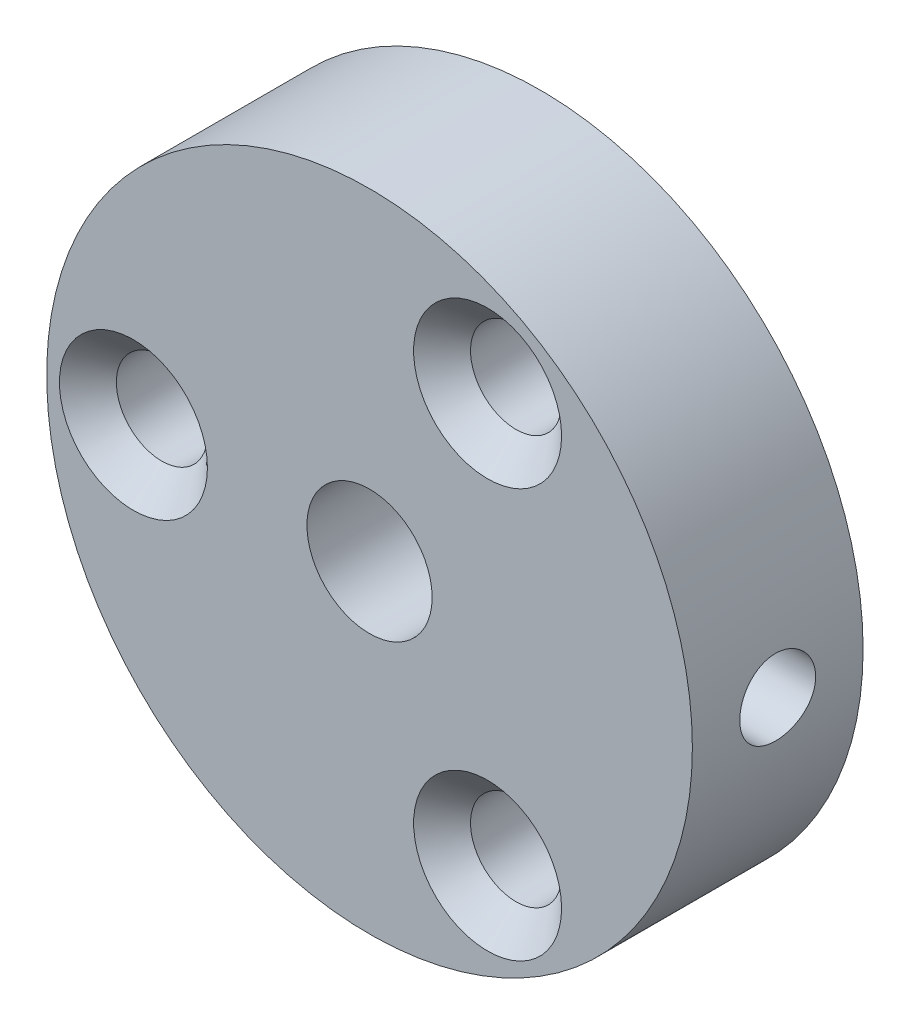
ISO-10303-21;
HEADER;
FILE_DESCRIPTION(('STEP AP214'),'2;1');
FILE_NAME('part.step','',(''),(''),'','','');
FILE_SCHEMA(('AUTOMOTIVE_DESIGN { 1 0 10303 214 1 1 1 1 }'));
ENDSEC;
DATA;
#1=APPLICATION_CONTEXT('core data for automotive mechanical design processes');
#2=APPLICATION_PROTOCOL_DEFINITION('international standard','automotive_design',2000,#1);
#3=PRODUCT_CONTEXT('',#1,'mechanical');
#4=PRODUCT('Part','Part','',(#3));
#5=PRODUCT_RELATED_PRODUCT_CATEGORY('part','',(#4));
#6=PRODUCT_DEFINITION_FORMATION('','',#4);
#7=PRODUCT_DEFINITION_CONTEXT('part definition',#1,'design');
#8=PRODUCT_DEFINITION('design','',#6,#7);
#9=PRODUCT_DEFINITION_SHAPE('','',#8);
#10=(LENGTH_UNIT() NAMED_UNIT(*) SI_UNIT(.MILLI.,.METRE.));
#11=(NAMED_UNIT(*) PLANE_ANGLE_UNIT() SI_UNIT($,.RADIAN.));
#12=(NAMED_UNIT(*) SI_UNIT($,.STERADIAN.) SOLID_ANGLE_UNIT());
#13=UNCERTAINTY_MEASURE_WITH_UNIT(LENGTH_MEASURE(1.E-05),#10,'distance_accuracy_value','');
#14=(GEOMETRIC_REPRESENTATION_CONTEXT(3) GLOBAL_UNCERTAINTY_ASSIGNED_CONTEXT((#13)) GLOBAL_UNIT_ASSIGNED_CONTEXT((#10,
#11,#12)) REPRESENTATION_CONTEXT('',''));
#15=CARTESIAN_POINT('',(0.,0.,0.));
#16=DIRECTION('',(0.,0.,1.));
#17=DIRECTION('',(1.,0.,0.));
#18=AXIS2_PLACEMENT_3D('',#15,#16,#17);
#19=CARTESIAN_POINT('',(0.,0.,2.25));
#20=DIRECTION('',(0.,0.,-1.));
#21=DIRECTION('',(-1.,0.,0.));
#22=AXIS2_PLACEMENT_3D('',#19,#20,#21);
#23=CYLINDRICAL_SURFACE('',#22,8.509);
#24=CARTESIAN_POINT('',(0.,0.,2.25));
#25=DIRECTION('',(0.,0.,1.));
#26=DIRECTION('',(1.,0.,0.));
#27=AXIS2_PLACEMENT_3D('',#24,#25,#26);
#28=CIRCLE('',#27,8.509);
#29=CARTESIAN_POINT('',(8.509,0.,2.25));
#30=VERTEX_POINT('',#29);
#31=EDGE_CURVE('E69',#30,#30,#28,.T.);
#32=ORIENTED_EDGE('',*,*,#31,.F.);
#33=EDGE_LOOP('',(#32));
#34=FACE_BOUND('',#33,.T.);
#35=CARTESIAN_POINT('',(0.,0.,-2.25));
#36=DIRECTION('',(0.,0.,1.));
#37=DIRECTION('',(1.,0.,0.));
#38=AXIS2_PLACEMENT_3D('',#35,#36,#37);
#39=CIRCLE('',#38,8.509);
#40=CARTESIAN_POINT('',(8.509,0.,-2.25));
#41=VERTEX_POINT('',#40);
#42=EDGE_CURVE('E70',#41,#41,#39,.T.);
#43=ORIENTED_EDGE('',*,*,#42,.T.);
#44=EDGE_LOOP('',(#43));
#45=FACE_BOUND('',#44,.T.);
#46=CARTESIAN_POINT('',(8.509,0.,1.));
#47=CARTESIAN_POINT('',(8.50899925825779,-0.0559634520903655,0.999997606608141));
#48=CARTESIAN_POINT('',(8.50844205250407,-0.111962530069736,0.995286305473793));
#49=CARTESIAN_POINT('',(8.50627283954904,-0.222404274914315,0.976565324354939));
#50=CARTESIAN_POINT('',(8.50465971141485,-0.276845223546583,0.962545762797024));
#51=CARTESIAN_POINT('',(8.5005604992414,-0.382555707204206,0.925625419940462));
#52=CARTESIAN_POINT('',(8.49807498355036,-0.433827281516426,0.902730419853047));
#53=CARTESIAN_POINT('',(8.49250791290803,-0.53179005335258,0.848721310130623));
#54=CARTESIAN_POINT('',(8.48942646544413,-0.578482074598571,0.817608682328109));
#55=CARTESIAN_POINT('',(8.48299508099071,-0.666198975034779,0.747884576200734));
#56=CARTESIAN_POINT('',(8.47964403116947,-0.707198237914693,0.709240970560579));
#57=CARTESIAN_POINT('',(8.47306017132751,-0.78214531751484,0.625620735354133));
#58=CARTESIAN_POINT('',(8.46982736715312,-0.816092785965369,0.580643793184871));
#59=CARTESIAN_POINT('',(8.4638349751161,-0.876066694216935,0.485468921310453));
#60=CARTESIAN_POINT('',(8.4610768172837,-0.902069374083602,0.435255921636007));
#61=CARTESIAN_POINT('',(8.45636045673469,-0.945263861567541,0.331138178339186));
#62=CARTESIAN_POINT('',(8.45440222711908,-0.962455965461184,0.277233558925333));
#63=CARTESIAN_POINT('',(8.45151792454899,-0.987463985059421,0.167527337329129));
#64=CARTESIAN_POINT('',(8.4505871147074,-0.995322943789538,0.11173567367804));
#65=CARTESIAN_POINT('',(8.44984849137229,-1.00157473295374,-0.000381874316133661));
#66=CARTESIAN_POINT('',(8.45004063777704,-0.999967901419329,-0.0567077395107053));
#67=CARTESIAN_POINT('',(8.45152188335809,-0.987369099886288,-0.167995889512193));
#68=CARTESIAN_POINT('',(8.45280545644521,-0.97642440820488,-0.222963610611169));
#69=CARTESIAN_POINT('',(8.45631630832853,-0.945534266900607,-0.330276708954445));
#70=CARTESIAN_POINT('',(8.45854360420851,-0.925588654337888,-0.382622038707648));
#71=CARTESIAN_POINT('',(8.46369724151993,-0.877211597513426,-0.483352135932232));
#72=CARTESIAN_POINT('',(8.46662528330115,-0.848759469796653,-0.531726879342225));
#73=CARTESIAN_POINT('',(8.47284914737392,-0.784191850599291,-0.623032829531791));
#74=CARTESIAN_POINT('',(8.47614498453892,-0.748076049150384,-0.66596381601854));
#75=CARTESIAN_POINT('',(8.48275767228527,-0.668943601082224,-0.745438120130147));
#76=CARTESIAN_POINT('',(8.48607452833307,-0.625886177186059,-0.781940847706062));
#77=CARTESIAN_POINT('',(8.49233665507728,-0.534233509907723,-0.8472068778295));
#78=CARTESIAN_POINT('',(8.49528192507732,-0.485638256147825,-0.875970165873205));
#79=CARTESIAN_POINT('',(8.50047056203787,-0.384259091367942,-0.924940327441846));
#80=CARTESIAN_POINT('',(8.50271373321242,-0.331474017117526,-0.945144814829844));
#81=CARTESIAN_POINT('',(8.50624359370688,-0.223228291924871,-0.976392420918683));
#82=CARTESIAN_POINT('',(8.50753032258151,-0.167767751730436,-0.987435918484318));
#83=CARTESIAN_POINT('',(8.50899719890482,-0.0560965520564369,-0.999995812028827));
#84=CARTESIAN_POINT('',(8.50918384434136,0.000107733177879293,-1.00156815357747));
#85=CARTESIAN_POINT('',(8.50844702966948,0.111979000745999,-0.995288517313536));
#86=CARTESIAN_POINT('',(8.50752359040205,0.167645993147293,-0.987436716432158));
#87=CARTESIAN_POINT('',(8.50467444269755,0.276698576186693,-0.962578137014735));
#88=CARTESIAN_POINT('',(8.50275163827508,0.330090294641814,-0.945597879606065));
#89=CARTESIAN_POINT('',(8.49811916421571,0.433268047041117,-0.902991864549742));
#90=CARTESIAN_POINT('',(8.49540947071746,0.483053971587247,-0.877365844727173));
#91=CARTESIAN_POINT('',(8.48948942178983,0.577857753132633,-0.81805928715919));
#92=CARTESIAN_POINT('',(8.48627682893315,0.622852714490904,-0.78434237696329));
#93=CARTESIAN_POINT('',(8.47971778274679,0.706564766332041,-0.709862817010008));
#94=CARTESIAN_POINT('',(8.47637132474337,0.745281637383764,-0.669099921084915));
#95=CARTESIAN_POINT('',(8.46990182241028,0.81553561305717,-0.581439797438692));
#96=CARTESIAN_POINT('',(8.46677998227011,0.847035749023108,-0.534512840023763));
#97=CARTESIAN_POINT('',(8.46113254328747,0.901707093846463,-0.43600169851697));
#98=CARTESIAN_POINT('',(8.45860693368037,0.924878453079572,-0.384417598530649));
#99=CARTESIAN_POINT('',(8.45444592773114,0.962173983214904,-0.278178146148385));
#100=CARTESIAN_POINT('',(8.45280844544353,0.976319367357207,-0.223530325847549));
#101=CARTESIAN_POINT('',(8.45060297021628,0.995229901415122,-0.112614703606158));
#102=CARTESIAN_POINT('',(8.45003493373592,0.999995433216293,-0.0563469677124958));
#103=CARTESIAN_POINT('',(8.45003382766369,1.00000453253293,0.0558435937758986));
#104=CARTESIAN_POINT('',(8.45059383593724,0.995306174273132,0.111766423535659));
#105=CARTESIAN_POINT('',(8.45277087882812,0.976643451037344,0.222021945402417));
#106=CARTESIAN_POINT('',(8.45438791394645,0.962679081669425,0.276354636755705));
#107=CARTESIAN_POINT('',(8.45849474268797,0.925898225279686,0.381882217127995));
#108=CARTESIAN_POINT('',(8.46098429441736,0.903084191524197,0.433077971204865));
#109=CARTESIAN_POINT('',(8.46655607777641,0.849257371181599,0.530923609507969));
#110=CARTESIAN_POINT('',(8.46963831340704,0.818244529247117,0.577573463043461));
#111=CARTESIAN_POINT('',(8.47607085048014,0.748683974172605,0.665300293273617));
#112=CARTESIAN_POINT('',(8.47942262416174,0.710092948476129,0.706342820454559));
#113=CARTESIAN_POINT('',(8.48600341074547,0.626560878199812,0.781392555080238));
#114=CARTESIAN_POINT('',(8.48923239437871,0.581618331529961,0.8153980936253));
#115=CARTESIAN_POINT('',(8.49521564998804,0.486486832924008,0.875504446750713));
#116=CARTESIAN_POINT('',(8.49796828151283,0.436280671168707,0.901578170652469));
#117=CARTESIAN_POINT('',(8.50267177238277,0.332199506306004,0.944888246073913));
#118=CARTESIAN_POINT('',(8.50462351307138,0.278328612615535,0.962134317219011));
#119=CARTESIAN_POINT('',(8.50702836747934,0.186808530738704,0.98311555113376));
#120=CARTESIAN_POINT('',(8.5077641777693,0.149739192003193,0.98943826597467));
#121=CARTESIAN_POINT('',(8.50875024147301,0.0751185847622236,0.99788128060772));
#122=CARTESIAN_POINT('',(8.50900049791901,0.0375673192678381,1.00000160664349));
#123=CARTESIAN_POINT('',(8.509,0.,1.));
#124=B_SPLINE_CURVE_WITH_KNOTS('',3,(#46,#47,#48,#49,#50,#51,#52,#53,#54,#55,#56,#57,#58,#59,
#60,#61,#62,#63,#64,#65,#66,#67,#68,#69,#70,#71,#72,#73,#74,#75,#76,#77,#78,#79,#80,#81,#82,#83,
#84,#85,#86,#87,#88,#89,#90,#91,#92,#93,#94,#95,#96,#97,#98,#99,#100,#101,#102,#103,#104,#105,
#106,#107,#108,#109,#110,#111,#112,#113,#114,#115,#116,#117,#118,#119,#120,#121,#122,#123),
.UNSPECIFIED.,.T.,.F.,(4,2,2,2,2,2,2,2,2,2,2,2,2,2,2,2,2,2,2,2,2,2,2,2,2,2,2,2,2,2,2,2,2,2,2,2,
2,2,4),(0.,0.167753147833018,0.335684666392649,0.503506982382304,0.671299056678312,
0.839823256160012,1.00835577663386,1.17738749066775,1.34641352023906,1.5146569626014,
1.68289439688221,1.85028505256265,2.01767873856674,2.18548279635464,2.35329364251334,
2.52212880997337,2.69096429383063,2.85984681697317,3.02872235540837,3.19659936984032,
3.36447323255681,3.53186198245332,3.69925580871837,3.86741673326328,4.03558353408464,
4.20459343340983,4.37360028111557,4.542208444151,4.71080974243499,4.87837958749061,
5.04594951197146,5.21347301658984,5.38099765213148,5.54950919624088,5.7180606590405,
5.88718149878873,6.05611572649447,6.16872628184058,6.28133613393927),.UNSPECIFIED.);
#125=CARTESIAN_POINT('',(8.509,0.,1.));
#126=VERTEX_POINT('',#125);
#127=EDGE_CURVE('E10',#126,#126,#124,.T.);
#128=ORIENTED_EDGE('',*,*,#127,.F.);
#129=EDGE_LOOP('',(#128));
#130=FACE_BOUND('',#129,.T.);
#131=ADVANCED_FACE('F34',(#34,#45,#130),#23,.T.);
#132=CARTESIAN_POINT('',(0.,0.,2.25));
#133=DIRECTION('',(0.,0.,1.));
#134=DIRECTION('',(1.,0.,0.));
#135=AXIS2_PLACEMENT_3D('',#132,#133,#134);
#136=PLANE('',#135);
#137=CARTESIAN_POINT('',(0.,0.,2.25));
#138=DIRECTION('',(0.,0.,1.));
#139=DIRECTION('',(1.,0.,0.));
#140=AXIS2_PLACEMENT_3D('',#137,#138,#139);
#141=CIRCLE('',#140,1.65);
#142=CARTESIAN_POINT('',(1.65,0.,2.25));
#143=VERTEX_POINT('',#142);
#144=EDGE_CURVE('E87',#143,#143,#141,.T.);
#145=ORIENTED_EDGE('',*,*,#144,.F.);
#146=EDGE_LOOP('',(#145));
#147=FACE_BOUND('',#146,.T.);
#148=CARTESIAN_POINT('',(-6.223,0.,2.25));
#149=DIRECTION('',(0.,0.,1.));
#150=DIRECTION('',(1.,0.,0.));
#151=AXIS2_PLACEMENT_3D('',#148,#149,#150);
#152=CIRCLE('',#151,1.94999999999999);
#153=CARTESIAN_POINT('',(-4.27300000000001,0.,2.25));
#154=VERTEX_POINT('',#153);
#155=EDGE_CURVE('E47',#154,#154,#152,.F.);
#156=ORIENTED_EDGE('',*,*,#155,.T.);
#157=EDGE_LOOP('',(#156));
#158=FACE_BOUND('',#157,.T.);
#159=CARTESIAN_POINT('',(3.11150000000001,5.38927608775055,2.25));
#160=DIRECTION('',(0.,0.,1.));
#161=DIRECTION('',(1.,0.,0.));
#162=AXIS2_PLACEMENT_3D('',#159,#160,#161);
#163=CIRCLE('',#162,1.94999999999998);
#164=CARTESIAN_POINT('',(5.06149999999999,5.38927608775055,2.25));
#165=VERTEX_POINT('',#164);
#166=EDGE_CURVE('E55',#165,#165,#163,.F.);
#167=ORIENTED_EDGE('',*,*,#166,.T.);
#168=EDGE_LOOP('',(#167));
#169=FACE_BOUND('',#168,.T.);
#170=CARTESIAN_POINT('',(3.11149999999999,-5.38927608775058,2.25));
#171=DIRECTION('',(0.,0.,1.));
#172=DIRECTION('',(1.,0.,0.));
#173=AXIS2_PLACEMENT_3D('',#170,#171,#172);
#174=CIRCLE('',#173,1.94999999999998);
#175=CARTESIAN_POINT('',(5.06149999999998,-5.38927608775058,2.25));
#176=VERTEX_POINT('',#175);
#177=EDGE_CURVE('E63',#176,#176,#174,.F.);
#178=ORIENTED_EDGE('',*,*,#177,.T.);
#179=EDGE_LOOP('',(#178));
#180=FACE_BOUND('',#179,.T.);
#181=ORIENTED_EDGE('',*,*,#31,.T.);
#182=EDGE_LOOP('',(#181));
#183=FACE_BOUND('',#182,.T.);
#184=ADVANCED_FACE('F109',(#147,#158,#169,#180,#183),#136,.T.);
#185=CARTESIAN_POINT('',(0.,0.,-2.25));
#186=DIRECTION('',(0.,0.,1.));
#187=DIRECTION('',(1.,0.,0.));
#188=AXIS2_PLACEMENT_3D('',#185,#186,#187);
#189=PLANE('',#188);
#190=CARTESIAN_POINT('',(0.,0.,-2.25));
#191=DIRECTION('',(0.,0.,1.));
#192=DIRECTION('',(1.,0.,0.));
#193=AXIS2_PLACEMENT_3D('',#190,#191,#192);
#194=CIRCLE('',#193,1.65);
#195=CARTESIAN_POINT('',(1.65,0.,-2.25));
#196=VERTEX_POINT('',#195);
#197=EDGE_CURVE('E84',#196,#196,#194,.T.);
#198=ORIENTED_EDGE('',*,*,#197,.T.);
#199=EDGE_LOOP('',(#198));
#200=FACE_BOUND('',#199,.T.);
#201=CARTESIAN_POINT('',(-6.223,0.,-2.25));
#202=DIRECTION('',(0.,0.,1.));
#203=DIRECTION('',(1.,0.,0.));
#204=AXIS2_PLACEMENT_3D('',#201,#202,#203);
#205=CIRCLE('',#204,1.2);
#206=CARTESIAN_POINT('',(-5.023,0.,-2.25));
#207=VERTEX_POINT('',#206);
#208=EDGE_CURVE('E81',#207,#207,#205,.T.);
#209=ORIENTED_EDGE('',*,*,#208,.T.);
#210=EDGE_LOOP('',(#209));
#211=FACE_BOUND('',#210,.T.);
#212=CARTESIAN_POINT('',(3.11150000000001,5.38927608775055,-2.25));
#213=DIRECTION('',(0.,0.,1.));
#214=DIRECTION('',(1.,0.,0.));
#215=AXIS2_PLACEMENT_3D('',#212,#213,#214);
#216=CIRCLE('',#215,1.2);
#217=CARTESIAN_POINT('',(4.31150000000001,5.38927608775055,-2.25));
#218=VERTEX_POINT('',#217);
#219=EDGE_CURVE('E78',#218,#218,#216,.T.);
#220=ORIENTED_EDGE('',*,*,#219,.T.);
#221=EDGE_LOOP('',(#220));
#222=FACE_BOUND('',#221,.T.);
#223=CARTESIAN_POINT('',(3.11149999999999,-5.38927608775058,-2.25));
#224=DIRECTION('',(0.,0.,1.));
#225=DIRECTION('',(1.,0.,0.));
#226=AXIS2_PLACEMENT_3D('',#223,#224,#225);
#227=CIRCLE('',#226,1.2);
#228=CARTESIAN_POINT('',(4.31149999999999,-5.38927608775058,-2.25));
#229=VERTEX_POINT('',#228);
#230=EDGE_CURVE('E73',#229,#229,#227,.T.);
#231=ORIENTED_EDGE('',*,*,#230,.T.);
#232=EDGE_LOOP('',(#231));
#233=FACE_BOUND('',#232,.T.);
#234=ORIENTED_EDGE('',*,*,#42,.F.);
#235=EDGE_LOOP('',(#234));
#236=FACE_BOUND('',#235,.T.);
#237=ADVANCED_FACE('F114',(#200,#211,#222,#233,#236),#189,.F.);
#238=CARTESIAN_POINT('',(3.11149999999999,-5.38927608775058,2.25));
#239=DIRECTION('',(0.,0.,1.));
#240=DIRECTION('',(1.,0.,0.));
#241=AXIS2_PLACEMENT_3D('',#238,#239,#240);
#242=CYLINDRICAL_SURFACE('',#241,1.19999999999999);
#243=CARTESIAN_POINT('',(3.11149999999999,-5.38927608775058,1.50000000000001));
#244=DIRECTION('',(0.,0.,1.));
#245=DIRECTION('',(1.,0.,0.));
#246=AXIS2_PLACEMENT_3D('',#243,#244,#245);
#247=CIRCLE('',#246,1.19999999999999);
#248=CARTESIAN_POINT('',(4.31149999999999,-5.38927608775058,1.50000000000001));
#249=VERTEX_POINT('',#248);
#250=EDGE_CURVE('E66',#249,#249,#247,.T.);
#251=ORIENTED_EDGE('',*,*,#250,.T.);
#252=EDGE_LOOP('',(#251));
#253=FACE_BOUND('',#252,.T.);
#254=ORIENTED_EDGE('',*,*,#230,.F.);
#255=EDGE_LOOP('',(#254));
#256=FACE_BOUND('',#255,.T.);
#257=ADVANCED_FACE('F146',(#253,#256),#242,.F.);
#258=CARTESIAN_POINT('',(3.11150000000001,5.38927608775055,2.25));
#259=DIRECTION('',(0.,0.,1.));
#260=DIRECTION('',(1.,0.,0.));
#261=AXIS2_PLACEMENT_3D('',#258,#259,#260);
#262=CYLINDRICAL_SURFACE('',#261,1.19999999999999);
#263=CARTESIAN_POINT('',(3.11150000000001,5.38927608775055,1.50000000000001));
#264=DIRECTION('',(0.,0.,1.));
#265=DIRECTION('',(1.,0.,0.));
#266=AXIS2_PLACEMENT_3D('',#263,#264,#265);
#267=CIRCLE('',#266,1.19999999999999);
#268=CARTESIAN_POINT('',(4.3115,5.38927608775055,1.50000000000001));
#269=VERTEX_POINT('',#268);
#270=EDGE_CURVE('E60',#269,#269,#267,.T.);
#271=ORIENTED_EDGE('',*,*,#270,.T.);
#272=EDGE_LOOP('',(#271));
#273=FACE_BOUND('',#272,.T.);
#274=ORIENTED_EDGE('',*,*,#219,.F.);
#275=EDGE_LOOP('',(#274));
#276=FACE_BOUND('',#275,.T.);
#277=ADVANCED_FACE('F143',(#273,#276),#262,.F.);
#278=CARTESIAN_POINT('',(-6.223,0.,2.25));
#279=DIRECTION('',(0.,0.,1.));
#280=DIRECTION('',(1.,0.,0.));
#281=AXIS2_PLACEMENT_3D('',#278,#279,#280);
#282=CYLINDRICAL_SURFACE('',#281,1.19999999999999);
#283=CARTESIAN_POINT('',(-6.223,0.,1.50000000000001));
#284=DIRECTION('',(0.,0.,1.));
#285=DIRECTION('',(1.,0.,0.));
#286=AXIS2_PLACEMENT_3D('',#283,#284,#285);
#287=CIRCLE('',#286,1.19999999999999);
#288=CARTESIAN_POINT('',(-5.02300000000001,0.,1.50000000000001));
#289=VERTEX_POINT('',#288);
#290=EDGE_CURVE('E51',#289,#289,#287,.T.);
#291=ORIENTED_EDGE('',*,*,#290,.T.);
#292=EDGE_LOOP('',(#291));
#293=FACE_BOUND('',#292,.T.);
#294=ORIENTED_EDGE('',*,*,#208,.F.);
#295=EDGE_LOOP('',(#294));
#296=FACE_BOUND('',#295,.T.);
#297=ADVANCED_FACE('F129',(#293,#296),#282,.F.);
#298=CARTESIAN_POINT('',(3.11149999999999,-5.38927608775058,1.50000000000001));
#299=DIRECTION('',(0.,0.,1.));
#300=DIRECTION('',(1.,0.,0.));
#301=AXIS2_PLACEMENT_3D('',#298,#299,#300);
#302=CONICAL_SURFACE('',#301,1.19999999999999,0.78539816339745);
#303=ORIENTED_EDGE('',*,*,#177,.F.);
#304=EDGE_LOOP('',(#303));
#305=FACE_BOUND('',#304,.T.);
#306=ORIENTED_EDGE('',*,*,#250,.F.);
#307=EDGE_LOOP('',(#306));
#308=FACE_BOUND('',#307,.T.);
#309=ADVANCED_FACE('F123',(#305,#308),#302,.F.);
#310=CARTESIAN_POINT('',(3.11150000000001,5.38927608775055,1.50000000000001));
#311=DIRECTION('',(0.,0.,1.));
#312=DIRECTION('',(1.,0.,0.));
#313=AXIS2_PLACEMENT_3D('',#310,#311,#312);
#314=CONICAL_SURFACE('',#313,1.19999999999999,0.78539816339745);
#315=ORIENTED_EDGE('',*,*,#166,.F.);
#316=EDGE_LOOP('',(#315));
#317=FACE_BOUND('',#316,.T.);
#318=ORIENTED_EDGE('',*,*,#270,.F.);
#319=EDGE_LOOP('',(#318));
#320=FACE_BOUND('',#319,.T.);
#321=ADVANCED_FACE('F128',(#317,#320),#314,.F.);
#322=CARTESIAN_POINT('',(-6.223,0.,1.50000000000001));
#323=DIRECTION('',(0.,0.,1.));
#324=DIRECTION('',(1.,0.,0.));
#325=AXIS2_PLACEMENT_3D('',#322,#323,#324);
#326=CONICAL_SURFACE('',#325,1.19999999999999,0.78539816339745);
#327=ORIENTED_EDGE('',*,*,#155,.F.);
#328=EDGE_LOOP('',(#327));
#329=FACE_BOUND('',#328,.T.);
#330=ORIENTED_EDGE('',*,*,#290,.F.);
#331=EDGE_LOOP('',(#330));
#332=FACE_BOUND('',#331,.T.);
#333=ADVANCED_FACE('F37',(#329,#332),#326,.F.);
#334=CARTESIAN_POINT('',(0.,0.,2.25));
#335=DIRECTION('',(0.,0.,1.));
#336=DIRECTION('',(1.,0.,0.));
#337=AXIS2_PLACEMENT_3D('',#334,#335,#336);
#338=CYLINDRICAL_SURFACE('',#337,1.65);
#339=ORIENTED_EDGE('',*,*,#197,.F.);
#340=EDGE_LOOP('',(#339));
#341=FACE_BOUND('',#340,.T.);
#342=ORIENTED_EDGE('',*,*,#144,.T.);
#343=EDGE_LOOP('',(#342));
#344=FACE_BOUND('',#343,.T.);
#345=ADVANCED_FACE('F98',(#341,#344),#338,.F.);
#346=CARTESIAN_POINT('',(8.509,0.,0.));
#347=DIRECTION('',(-1.,0.,0.));
#348=DIRECTION('',(0.,0.,1.));
#349=AXIS2_PLACEMENT_3D('',#346,#347,#348);
#350=CYLINDRICAL_SURFACE('',#349,1.);
#351=CARTESIAN_POINT('',(5.,0.,0.));
#352=DIRECTION('',(1.,0.,0.));
#353=DIRECTION('',(0.,0.,-1.));
#354=AXIS2_PLACEMENT_3D('',#351,#352,#353);
#355=CIRCLE('',#354,1.);
#356=CARTESIAN_POINT('',(5.,0.,-1.));
#357=VERTEX_POINT('',#356);
#358=EDGE_CURVE('E90',#357,#357,#355,.T.);
#359=ORIENTED_EDGE('',*,*,#358,.F.);
#360=EDGE_LOOP('',(#359));
#361=FACE_BOUND('',#360,.T.);
#362=ORIENTED_EDGE('',*,*,#127,.T.);
#363=EDGE_LOOP('',(#362));
#364=FACE_BOUND('',#363,.T.);
#365=ADVANCED_FACE('F96',(#361,#364),#350,.F.);
#366=CARTESIAN_POINT('',(5.,0.,0.));
#367=DIRECTION('',(1.,0.,0.));
#368=DIRECTION('',(0.,0.,-1.));
#369=AXIS2_PLACEMENT_3D('',#366,#367,#368);
#370=PLANE('',#369);
#371=ORIENTED_EDGE('',*,*,#358,.T.);
#372=EDGE_LOOP('',(#371));
#373=FACE_BOUND('',#372,.T.);
#374=ADVANCED_FACE('F94',(#373),#370,.T.);
#375=CLOSED_SHELL('',(#131,#184,#237,#257,#277,#297,#309,#321,#333,#345,#365,#374));
#376=MANIFOLD_SOLID_BREP('B2',#375);
#377=ADVANCED_BREP_SHAPE_REPRESENTATION('',(#18,#376),#14);
#378=SHAPE_DEFINITION_REPRESENTATION(#9,#377);
ENDSEC;
END-ISO-10303-21;
